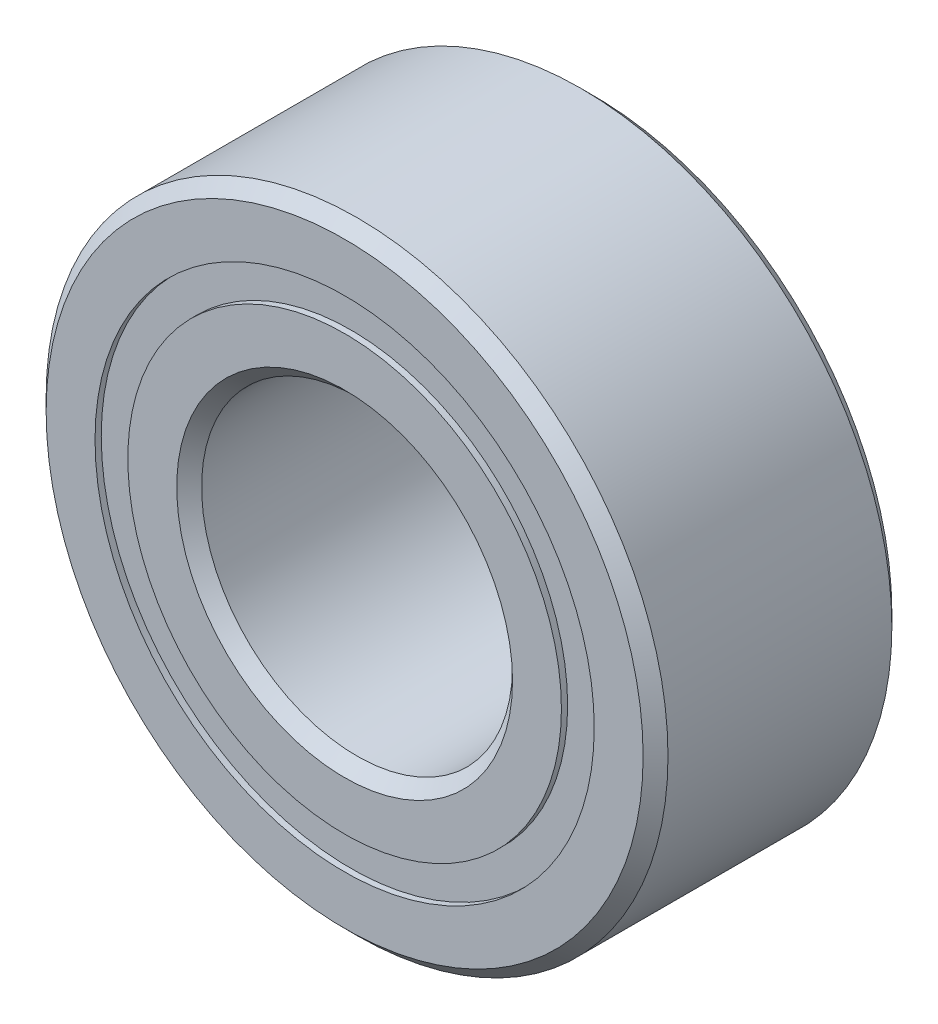
ISO-10303-21;
HEADER;
FILE_DESCRIPTION(('STEP AP214'),'2;1');
FILE_NAME('part.step','',(''),(''),'','','');
FILE_SCHEMA(('AUTOMOTIVE_DESIGN { 1 0 10303 214 1 1 1 1 }'));
ENDSEC;
DATA;
#1=APPLICATION_CONTEXT('core data for automotive mechanical design processes');
#2=APPLICATION_PROTOCOL_DEFINITION('international standard','automotive_design',2000,#1);
#3=PRODUCT_CONTEXT('',#1,'mechanical');
#4=PRODUCT('Part','Part','',(#3));
#5=PRODUCT_RELATED_PRODUCT_CATEGORY('part','',(#4));
#6=PRODUCT_DEFINITION_FORMATION('','',#4);
#7=PRODUCT_DEFINITION_CONTEXT('part definition',#1,'design');
#8=PRODUCT_DEFINITION('design','',#6,#7);
#9=PRODUCT_DEFINITION_SHAPE('','',#8);
#10=(LENGTH_UNIT() NAMED_UNIT(*) SI_UNIT(.MILLI.,.METRE.));
#11=(NAMED_UNIT(*) PLANE_ANGLE_UNIT() SI_UNIT($,.RADIAN.));
#12=(NAMED_UNIT(*) SI_UNIT($,.STERADIAN.) SOLID_ANGLE_UNIT());
#13=UNCERTAINTY_MEASURE_WITH_UNIT(LENGTH_MEASURE(1.E-05),#10,'distance_accuracy_value','');
#14=(GEOMETRIC_REPRESENTATION_CONTEXT(3) GLOBAL_UNCERTAINTY_ASSIGNED_CONTEXT((#13)) GLOBAL_UNIT_ASSIGNED_CONTEXT((#10,
#11,#12)) REPRESENTATION_CONTEXT('',''));
#15=CARTESIAN_POINT('',(0.,0.,0.));
#16=DIRECTION('',(0.,0.,1.));
#17=DIRECTION('',(1.,0.,0.));
#18=AXIS2_PLACEMENT_3D('',#15,#16,#17);
#19=CARTESIAN_POINT('',(0.,3.18590315934042,-1.50812500000014));
#20=DIRECTION('',(0.,0.,1.));
#21=DIRECTION('',(1.,0.,0.));
#22=AXIS2_PLACEMENT_3D('',#19,#20,#21);
#23=PLANE('',#22);
#24=CARTESIAN_POINT('',(0.,0.,-1.50812500000022));
#25=DIRECTION('',(0.,0.,1.));
#26=DIRECTION('',(1.,0.,0.));
#27=AXIS2_PLACEMENT_3D('',#24,#25,#26);
#28=CIRCLE('',#27,3.18590315934066);
#29=CARTESIAN_POINT('',(3.18590315934066,0.,-1.50812500000022));
#30=VERTEX_POINT('',#29);
#31=EDGE_CURVE('E59',#30,#30,#28,.T.);
#32=ORIENTED_EDGE('',*,*,#31,.F.);
#33=EDGE_LOOP('',(#32));
#34=FACE_BOUND('',#33,.T.);
#35=CARTESIAN_POINT('',(0.,0.,-1.50812500000022));
#36=DIRECTION('',(0.,0.,1.));
#37=DIRECTION('',(1.,0.,0.));
#38=AXIS2_PLACEMENT_3D('',#35,#36,#37);
#39=CIRCLE('',#38,2.76722184065934);
#40=CARTESIAN_POINT('',(2.76722184065934,0.,-1.50812500000022));
#41=VERTEX_POINT('',#40);
#42=EDGE_CURVE('E11',#41,#41,#39,.T.);
#43=ORIENTED_EDGE('',*,*,#42,.T.);
#44=EDGE_LOOP('',(#43));
#45=FACE_BOUND('',#44,.T.);
#46=ADVANCED_FACE('F45',(#34,#45),#23,.F.);
#47=CARTESIAN_POINT('',(0.,0.,1.58750000000016));
#48=DIRECTION('',(0.,0.,1.));
#49=DIRECTION('',(1.,0.,0.));
#50=AXIS2_PLACEMENT_3D('',#47,#48,#49);
#51=CYLINDRICAL_SURFACE('',#50,2.76722184065934);
#52=ORIENTED_EDGE('',*,*,#42,.F.);
#53=EDGE_LOOP('',(#52));
#54=FACE_BOUND('',#53,.T.);
#55=CARTESIAN_POINT('',(0.,0.,-0.735956624828324));
#56=DIRECTION('',(0.,0.,1.));
#57=DIRECTION('',(1.,0.,0.));
#58=AXIS2_PLACEMENT_3D('',#55,#56,#57);
#59=CIRCLE('',#58,2.76722184065934);
#60=CARTESIAN_POINT('',(2.76722184065934,0.,-0.735956624828324));
#61=VERTEX_POINT('',#60);
#62=EDGE_CURVE('E51',#61,#61,#59,.T.);
#63=ORIENTED_EDGE('',*,*,#62,.T.);
#64=EDGE_LOOP('',(#63));
#65=FACE_BOUND('',#64,.T.);
#66=ADVANCED_FACE('F68',(#54,#65),#51,.F.);
#67=CARTESIAN_POINT('',(0.,3.18590315934042,-0.73595662482831));
#68=DIRECTION('',(0.,0.,-1.));
#69=DIRECTION('',(-1.,0.,0.));
#70=AXIS2_PLACEMENT_3D('',#67,#68,#69);
#71=PLANE('',#70);
#72=ORIENTED_EDGE('',*,*,#62,.F.);
#73=EDGE_LOOP('',(#72));
#74=FACE_BOUND('',#73,.T.);
#75=CARTESIAN_POINT('',(0.,0.,-0.735956624828324));
#76=DIRECTION('',(0.,0.,1.));
#77=DIRECTION('',(1.,0.,0.));
#78=AXIS2_PLACEMENT_3D('',#75,#76,#77);
#79=CIRCLE('',#78,3.18590315934066);
#80=CARTESIAN_POINT('',(3.18590315934066,0.,-0.735956624828324));
#81=VERTEX_POINT('',#80);
#82=EDGE_CURVE('E55',#81,#81,#79,.T.);
#83=ORIENTED_EDGE('',*,*,#82,.T.);
#84=EDGE_LOOP('',(#83));
#85=FACE_BOUND('',#84,.T.);
#86=ADVANCED_FACE('F72',(#74,#85),#71,.F.);
#87=CARTESIAN_POINT('',(0.,0.,1.58750000000016));
#88=DIRECTION('',(0.,0.,1.));
#89=DIRECTION('',(1.,0.,0.));
#90=AXIS2_PLACEMENT_3D('',#87,#88,#89);
#91=CYLINDRICAL_SURFACE('',#90,3.18590315934066);
#92=ORIENTED_EDGE('',*,*,#82,.F.);
#93=EDGE_LOOP('',(#92));
#94=FACE_BOUND('',#93,.T.);
#95=ORIENTED_EDGE('',*,*,#31,.T.);
#96=EDGE_LOOP('',(#95));
#97=FACE_BOUND('',#96,.T.);
#98=ADVANCED_FACE('F65',(#94,#97),#91,.T.);
#99=CLOSED_SHELL('',(#46,#66,#86,#98));
#100=MANIFOLD_SOLID_BREP('B2',#99);
#101=CARTESIAN_POINT('',(0.,3.18590315934042,1.50812499999994));
#102=DIRECTION('',(0.,0.,-1.));
#103=DIRECTION('',(-1.,0.,0.));
#104=AXIS2_PLACEMENT_3D('',#101,#102,#103);
#105=PLANE('',#104);
#106=CARTESIAN_POINT('',(0.,0.,1.50812499999999));
#107=DIRECTION('',(0.,0.,1.));
#108=DIRECTION('',(1.,0.,0.));
#109=AXIS2_PLACEMENT_3D('',#106,#107,#108);
#110=CIRCLE('',#109,2.76722184065934);
#111=CARTESIAN_POINT('',(2.76722184065934,0.,1.50812499999999));
#112=VERTEX_POINT('',#111);
#113=EDGE_CURVE('E44',#112,#112,#110,.T.);
#114=ORIENTED_EDGE('',*,*,#113,.F.);
#115=EDGE_LOOP('',(#114));
#116=FACE_BOUND('',#115,.T.);
#117=CARTESIAN_POINT('',(0.,0.,1.50812499999999));
#118=DIRECTION('',(0.,0.,1.));
#119=DIRECTION('',(1.,0.,0.));
#120=AXIS2_PLACEMENT_3D('',#117,#118,#119);
#121=CIRCLE('',#120,3.18590315934066);
#122=CARTESIAN_POINT('',(3.18590315934066,0.,1.50812499999999));
#123=VERTEX_POINT('',#122);
#124=EDGE_CURVE('E126',#123,#123,#121,.T.);
#125=ORIENTED_EDGE('',*,*,#124,.T.);
#126=EDGE_LOOP('',(#125));
#127=FACE_BOUND('',#126,.T.);
#128=ADVANCED_FACE('F112',(#116,#127),#105,.F.);
#129=CARTESIAN_POINT('',(0.,0.,1.58750000000016));
#130=DIRECTION('',(0.,0.,1.));
#131=DIRECTION('',(1.,0.,0.));
#132=AXIS2_PLACEMENT_3D('',#129,#130,#131);
#133=CYLINDRICAL_SURFACE('',#132,2.76722184065934);
#134=CARTESIAN_POINT('',(0.,0.,0.735956624828144));
#135=DIRECTION('',(0.,0.,1.));
#136=DIRECTION('',(1.,0.,0.));
#137=AXIS2_PLACEMENT_3D('',#134,#135,#136);
#138=CIRCLE('',#137,2.76722184065934);
#139=CARTESIAN_POINT('',(2.76722184065934,0.,0.735956624828144));
#140=VERTEX_POINT('',#139);
#141=EDGE_CURVE('E118',#140,#140,#138,.T.);
#142=ORIENTED_EDGE('',*,*,#141,.F.);
#143=EDGE_LOOP('',(#142));
#144=FACE_BOUND('',#143,.T.);
#145=ORIENTED_EDGE('',*,*,#113,.T.);
#146=EDGE_LOOP('',(#145));
#147=FACE_BOUND('',#146,.T.);
#148=ADVANCED_FACE('F141',(#144,#147),#133,.F.);
#149=CARTESIAN_POINT('',(0.,3.18590315934042,0.73595662482813));
#150=DIRECTION('',(0.,0.,1.));
#151=DIRECTION('',(1.,0.,0.));
#152=AXIS2_PLACEMENT_3D('',#149,#150,#151);
#153=PLANE('',#152);
#154=CARTESIAN_POINT('',(0.,0.,0.735956624828144));
#155=DIRECTION('',(0.,0.,1.));
#156=DIRECTION('',(1.,0.,0.));
#157=AXIS2_PLACEMENT_3D('',#154,#155,#156);
#158=CIRCLE('',#157,3.18590315934066);
#159=CARTESIAN_POINT('',(3.18590315934066,0.,0.735956624828144));
#160=VERTEX_POINT('',#159);
#161=EDGE_CURVE('E122',#160,#160,#158,.T.);
#162=ORIENTED_EDGE('',*,*,#161,.F.);
#163=EDGE_LOOP('',(#162));
#164=FACE_BOUND('',#163,.T.);
#165=ORIENTED_EDGE('',*,*,#141,.T.);
#166=EDGE_LOOP('',(#165));
#167=FACE_BOUND('',#166,.T.);
#168=ADVANCED_FACE('F136',(#164,#167),#153,.F.);
#169=CARTESIAN_POINT('',(0.,0.,1.58750000000016));
#170=DIRECTION('',(0.,0.,1.));
#171=DIRECTION('',(1.,0.,0.));
#172=AXIS2_PLACEMENT_3D('',#169,#170,#171);
#173=CYLINDRICAL_SURFACE('',#172,3.18590315934066);
#174=ORIENTED_EDGE('',*,*,#124,.F.);
#175=EDGE_LOOP('',(#174));
#176=FACE_BOUND('',#175,.T.);
#177=ORIENTED_EDGE('',*,*,#161,.T.);
#178=EDGE_LOOP('',(#177));
#179=FACE_BOUND('',#178,.T.);
#180=ADVANCED_FACE('F133',(#176,#179),#173,.T.);
#181=CLOSED_SHELL('',(#128,#148,#168,#180));
#182=MANIFOLD_SOLID_BREP('B6',#181);
#183=CARTESIAN_POINT('',(-1.48828124999989,2.57777874095222,0.));
#184=DIRECTION('',(0.,0.,1.));
#185=DIRECTION('',(-0.499999999999989,0.866025403784445,0.));
#186=AXIS2_PLACEMENT_3D('',#183,#184,#185);
#187=SPHERICAL_SURFACE('',#186,0.735956624828183);
#188=CARTESIAN_POINT('',(-1.48828124999989,2.57777874095222,0.735956624828183));
#189=VERTEX_POINT('',#188);
#190=VERTEX_LOOP('',#189);
#191=FACE_BOUND('',#190,.T.);
#192=ADVANCED_FACE('F179',(#191),#187,.T.);
#193=CLOSED_SHELL('',(#192));
#194=MANIFOLD_SOLID_BREP('B39',#193);
#195=CARTESIAN_POINT('',(-2.57777874095222,1.48828125000033,0.));
#196=DIRECTION('',(0.,0.,1.));
#197=DIRECTION('',(-0.866025403784433,0.500000000000011,0.));
#198=AXIS2_PLACEMENT_3D('',#195,#196,#197);
#199=SPHERICAL_SURFACE('',#198,0.735956624828183);
#200=CARTESIAN_POINT('',(-2.57777874095222,1.48828125000033,0.735956624828141));
#201=VERTEX_POINT('',#200);
#202=VERTEX_LOOP('',#201);
#203=FACE_BOUND('',#202,.T.);
#204=ADVANCED_FACE('F199',(#203),#199,.T.);
#205=CLOSED_SHELL('',(#204));
#206=MANIFOLD_SOLID_BREP('B108',#205);
#207=CARTESIAN_POINT('',(-2.97656249999978,0.,0.));
#208=DIRECTION('',(0.,0.,1.));
#209=DIRECTION('',(-1.,0.,0.));
#210=AXIS2_PLACEMENT_3D('',#207,#208,#209);
#211=SPHERICAL_SURFACE('',#210,0.735956624828183);
#212=CARTESIAN_POINT('',(-2.97656249999978,0.,0.735956624828169));
#213=VERTEX_POINT('',#212);
#214=VERTEX_LOOP('',#213);
#215=FACE_BOUND('',#214,.T.);
#216=ADVANCED_FACE('F219',(#215),#211,.T.);
#217=CLOSED_SHELL('',(#216));
#218=MANIFOLD_SOLID_BREP('B175',#217);
#219=CARTESIAN_POINT('',(-2.57777874095222,-1.48828125000033,0.));
#220=DIRECTION('',(0.,0.,1.));
#221=DIRECTION('',(-0.866025403784443,-0.499999999999992,0.));
#222=AXIS2_PLACEMENT_3D('',#219,#220,#221);
#223=SPHERICAL_SURFACE('',#222,0.735956624828183);
#224=CARTESIAN_POINT('',(-2.57777874095222,-1.48828125000033,0.735956624828141));
#225=VERTEX_POINT('',#224);
#226=VERTEX_LOOP('',#225);
#227=FACE_BOUND('',#226,.T.);
#228=ADVANCED_FACE('F239',(#227),#223,.T.);
#229=CLOSED_SHELL('',(#228));
#230=MANIFOLD_SOLID_BREP('B195',#229);
#231=CARTESIAN_POINT('',(-1.48828124999989,-2.57777874095222,0.));
#232=DIRECTION('',(0.,0.,1.));
#233=DIRECTION('',(-0.500000000000007,-0.866025403784435,0.));
#234=AXIS2_PLACEMENT_3D('',#231,#232,#233);
#235=SPHERICAL_SURFACE('',#234,0.735956624828183);
#236=CARTESIAN_POINT('',(-1.48828124999989,-2.57777874095222,0.735956624828141));
#237=VERTEX_POINT('',#236);
#238=VERTEX_LOOP('',#237);
#239=FACE_BOUND('',#238,.T.);
#240=ADVANCED_FACE('F259',(#239),#235,.T.);
#241=CLOSED_SHELL('',(#240));
#242=MANIFOLD_SOLID_BREP('B215',#241);
#243=CARTESIAN_POINT('',(0.,-2.97656249999978,0.));
#244=DIRECTION('',(0.,0.,1.));
#245=DIRECTION('',(0.,-1.,0.));
#246=AXIS2_PLACEMENT_3D('',#243,#244,#245);
#247=SPHERICAL_SURFACE('',#246,0.735956624828183);
#248=CARTESIAN_POINT('',(0.,-2.97656249999978,0.735956624828155));
#249=VERTEX_POINT('',#248);
#250=VERTEX_LOOP('',#249);
#251=FACE_BOUND('',#250,.T.);
#252=ADVANCED_FACE('F279',(#251),#247,.T.);
#253=CLOSED_SHELL('',(#252));
#254=MANIFOLD_SOLID_BREP('B235',#253);
#255=CARTESIAN_POINT('',(1.48828124999989,-2.57777874095222,0.));
#256=DIRECTION('',(0.,0.,1.));
#257=DIRECTION('',(0.499999999999995,-0.866025403784442,0.));
#258=AXIS2_PLACEMENT_3D('',#255,#256,#257);
#259=SPHERICAL_SURFACE('',#258,0.735956624828183);
#260=CARTESIAN_POINT('',(1.48828124999989,-2.57777874095222,0.735956624828155));
#261=VERTEX_POINT('',#260);
#262=VERTEX_LOOP('',#261);
#263=FACE_BOUND('',#262,.T.);
#264=ADVANCED_FACE('F299',(#263),#259,.T.);
#265=CLOSED_SHELL('',(#264));
#266=MANIFOLD_SOLID_BREP('B255',#265);
#267=CARTESIAN_POINT('',(2.57777874095222,-1.48828125000033,0.));
#268=DIRECTION('',(0.,0.,1.));
#269=DIRECTION('',(0.866025403784437,-0.500000000000005,0.));
#270=AXIS2_PLACEMENT_3D('',#267,#268,#269);
#271=SPHERICAL_SURFACE('',#270,0.735956624828183);
#272=CARTESIAN_POINT('',(2.57777874095222,-1.48828125000033,0.735956624828169));
#273=VERTEX_POINT('',#272);
#274=VERTEX_LOOP('',#273);
#275=FACE_BOUND('',#274,.T.);
#276=ADVANCED_FACE('F319',(#275),#271,.T.);
#277=CLOSED_SHELL('',(#276));
#278=MANIFOLD_SOLID_BREP('B275',#277);
#279=CARTESIAN_POINT('',(2.97656249999978,0.,0.));
#280=DIRECTION('',(0.,0.,1.));
#281=DIRECTION('',(1.,0.,0.));
#282=AXIS2_PLACEMENT_3D('',#279,#280,#281);
#283=SPHERICAL_SURFACE('',#282,0.735956624828183);
#284=CARTESIAN_POINT('',(2.97656249999978,0.,0.735956624828197));
#285=VERTEX_POINT('',#284);
#286=VERTEX_LOOP('',#285);
#287=FACE_BOUND('',#286,.T.);
#288=ADVANCED_FACE('F339',(#287),#283,.T.);
#289=CLOSED_SHELL('',(#288));
#290=MANIFOLD_SOLID_BREP('B295',#289);
#291=CARTESIAN_POINT('',(2.57777874095222,1.48828125000033,0.));
#292=DIRECTION('',(0.,0.,1.));
#293=DIRECTION('',(0.86602540378444,0.499999999999998,0.));
#294=AXIS2_PLACEMENT_3D('',#291,#292,#293);
#295=SPHERICAL_SURFACE('',#294,0.735956624828183);
#296=CARTESIAN_POINT('',(2.57777874095222,1.48828125000033,0.735956624828169));
#297=VERTEX_POINT('',#296);
#298=VERTEX_LOOP('',#297);
#299=FACE_BOUND('',#298,.T.);
#300=ADVANCED_FACE('F359',(#299),#295,.T.);
#301=CLOSED_SHELL('',(#300));
#302=MANIFOLD_SOLID_BREP('B315',#301);
#303=CARTESIAN_POINT('',(1.48828124999989,2.57777874095222,0.));
#304=DIRECTION('',(0.,0.,1.));
#305=DIRECTION('',(0.500000000000001,0.866025403784438,0.));
#306=AXIS2_PLACEMENT_3D('',#303,#304,#305);
#307=SPHERICAL_SURFACE('',#306,0.735956624828183);
#308=CARTESIAN_POINT('',(1.48828124999989,2.57777874095222,0.735956624828155));
#309=VERTEX_POINT('',#308);
#310=VERTEX_LOOP('',#309);
#311=FACE_BOUND('',#310,.T.);
#312=ADVANCED_FACE('F379',(#311),#307,.T.);
#313=CLOSED_SHELL('',(#312));
#314=MANIFOLD_SOLID_BREP('B335',#313);
#315=CARTESIAN_POINT('',(0.,2.97656249999978,0.));
#316=DIRECTION('',(0.,0.,1.));
#317=DIRECTION('',(0.,1.,0.));
#318=AXIS2_PLACEMENT_3D('',#315,#316,#317);
#319=SPHERICAL_SURFACE('',#318,0.735956624828183);
#320=CARTESIAN_POINT('',(0.,2.97656249999978,0.735956624828266));
#321=VERTEX_POINT('',#320);
#322=VERTEX_LOOP('',#321);
#323=FACE_BOUND('',#322,.T.);
#324=ADVANCED_FACE('F401',(#323),#319,.T.);
#325=CLOSED_SHELL('',(#324));
#326=MANIFOLD_SOLID_BREP('B355',#325);
#327=CARTESIAN_POINT('',(0.,2.76722184065914,1.58749999999999));
#328=DIRECTION('',(0.,0.,-1.));
#329=DIRECTION('',(-1.,0.,0.));
#330=AXIS2_PLACEMENT_3D('',#327,#328,#329);
#331=PLANE('',#330);
#332=CARTESIAN_POINT('',(0.,0.,1.58750000000016));
#333=DIRECTION('',(0.,0.,1.));
#334=DIRECTION('',(1.,0.,0.));
#335=AXIS2_PLACEMENT_3D('',#332,#333,#334);
#336=CIRCLE('',#335,2.143125);
#337=CARTESIAN_POINT('',(2.143125,0.,1.58750000000016));
#338=VERTEX_POINT('',#337);
#339=EDGE_CURVE('E448',#338,#338,#336,.T.);
#340=ORIENTED_EDGE('',*,*,#339,.F.);
#341=EDGE_LOOP('',(#340));
#342=FACE_BOUND('',#341,.T.);
#343=CARTESIAN_POINT('',(0.,0.,1.58750000000016));
#344=DIRECTION('',(0.,0.,1.));
#345=DIRECTION('',(1.,0.,0.));
#346=AXIS2_PLACEMENT_3D('',#343,#344,#345);
#347=CIRCLE('',#346,2.76722184065934);
#348=CARTESIAN_POINT('',(2.76722184065934,0.,1.58750000000016));
#349=VERTEX_POINT('',#348);
#350=EDGE_CURVE('E400',#349,#349,#347,.T.);
#351=ORIENTED_EDGE('',*,*,#350,.T.);
#352=EDGE_LOOP('',(#351));
#353=FACE_BOUND('',#352,.T.);
#354=ADVANCED_FACE('F420',(#342,#353),#331,.F.);
#355=CARTESIAN_POINT('',(0.,0.,1.58750000000016));
#356=DIRECTION('',(0.,0.,1.));
#357=DIRECTION('',(1.,0.,0.));
#358=AXIS2_PLACEMENT_3D('',#355,#356,#357);
#359=CYLINDRICAL_SURFACE('',#358,2.76722184065934);
#360=ORIENTED_EDGE('',*,*,#350,.F.);
#361=EDGE_LOOP('',(#360));
#362=FACE_BOUND('',#361,.T.);
#363=CARTESIAN_POINT('',(0.,0.,0.705555555555543));
#364=DIRECTION('',(0.,0.,1.));
#365=DIRECTION('',(1.,0.,0.));
#366=AXIS2_PLACEMENT_3D('',#363,#364,#365);
#367=CIRCLE('',#366,2.76722184065934);
#368=CARTESIAN_POINT('',(2.76722184065934,0.,0.705555555555543));
#369=VERTEX_POINT('',#368);
#370=EDGE_CURVE('E426',#369,#369,#367,.T.);
#371=ORIENTED_EDGE('',*,*,#370,.T.);
#372=EDGE_LOOP('',(#371));
#373=FACE_BOUND('',#372,.T.);
#374=ADVANCED_FACE('F455',(#362,#373),#359,.T.);
#375=CARTESIAN_POINT('',(0.,0.,0.));
#376=DIRECTION('',(0.,0.,1.));
#377=DIRECTION('',(1.,0.,0.));
#378=AXIS2_PLACEMENT_3D('',#375,#376,#377);
#379=TOROIDAL_SURFACE('',#378,2.97656249999999,0.735956624828181);
#380=ORIENTED_EDGE('',*,*,#370,.F.);
#381=EDGE_LOOP('',(#380));
#382=FACE_BOUND('',#381,.T.);
#383=CARTESIAN_POINT('',(0.,0.,-0.705555555555612));
#384=DIRECTION('',(0.,0.,1.));
#385=DIRECTION('',(1.,0.,0.));
#386=AXIS2_PLACEMENT_3D('',#383,#384,#385);
#387=CIRCLE('',#386,2.76722184065934);
#388=CARTESIAN_POINT('',(2.76722184065934,0.,-0.705555555555612));
#389=VERTEX_POINT('',#388);
#390=EDGE_CURVE('E430',#389,#389,#387,.T.);
#391=ORIENTED_EDGE('',*,*,#390,.T.);
#392=EDGE_LOOP('',(#391));
#393=FACE_BOUND('',#392,.T.);
#394=ADVANCED_FACE('F459',(#382,#393),#379,.F.);
#395=CARTESIAN_POINT('',(0.,0.,1.58750000000016));
#396=DIRECTION('',(0.,0.,1.));
#397=DIRECTION('',(1.,0.,0.));
#398=AXIS2_PLACEMENT_3D('',#395,#396,#397);
#399=CYLINDRICAL_SURFACE('',#398,2.76722184065934);
#400=ORIENTED_EDGE('',*,*,#390,.F.);
#401=EDGE_LOOP('',(#400));
#402=FACE_BOUND('',#401,.T.);
#403=CARTESIAN_POINT('',(0.,0.,-1.58750000000012));
#404=DIRECTION('',(0.,0.,1.));
#405=DIRECTION('',(1.,0.,0.));
#406=AXIS2_PLACEMENT_3D('',#403,#404,#405);
#407=CIRCLE('',#406,2.76722184065934);
#408=CARTESIAN_POINT('',(2.76722184065934,0.,-1.58750000000012));
#409=VERTEX_POINT('',#408);
#410=EDGE_CURVE('E434',#409,#409,#407,.T.);
#411=ORIENTED_EDGE('',*,*,#410,.T.);
#412=EDGE_LOOP('',(#411));
#413=FACE_BOUND('',#412,.T.);
#414=ADVANCED_FACE('F464',(#402,#413),#399,.T.);
#415=CARTESIAN_POINT('',(0.,2.14312499999991,-1.58750000000012));
#416=DIRECTION('',(0.,0.,1.));
#417=DIRECTION('',(1.,0.,0.));
#418=AXIS2_PLACEMENT_3D('',#415,#416,#417);
#419=PLANE('',#418);
#420=ORIENTED_EDGE('',*,*,#410,.F.);
#421=EDGE_LOOP('',(#420));
#422=FACE_BOUND('',#421,.T.);
#423=CARTESIAN_POINT('',(0.,0.,-1.58750000000012));
#424=DIRECTION('',(0.,0.,1.));
#425=DIRECTION('',(1.,0.,0.));
#426=AXIS2_PLACEMENT_3D('',#423,#424,#425);
#427=CIRCLE('',#426,2.143125);
#428=CARTESIAN_POINT('',(2.143125,0.,-1.58750000000012));
#429=VERTEX_POINT('',#428);
#430=EDGE_CURVE('E439',#429,#429,#427,.T.);
#431=ORIENTED_EDGE('',*,*,#430,.T.);
#432=EDGE_LOOP('',(#431));
#433=FACE_BOUND('',#432,.T.);
#434=ADVANCED_FACE('F470',(#422,#433),#419,.F.);
#435=CARTESIAN_POINT('',(0.,0.,-1.42875000000009));
#436=DIRECTION('',(0.,0.,-1.));
#437=DIRECTION('',(-1.,0.,0.));
#438=AXIS2_PLACEMENT_3D('',#435,#436,#437);
#439=CONICAL_SURFACE('',#438,1.984375,0.78539816339745);
#440=ORIENTED_EDGE('',*,*,#430,.F.);
#441=EDGE_LOOP('',(#440));
#442=FACE_BOUND('',#441,.T.);
#443=CARTESIAN_POINT('',(0.,0.,-1.42875000000009));
#444=DIRECTION('',(0.,0.,1.));
#445=DIRECTION('',(1.,0.,0.));
#446=AXIS2_PLACEMENT_3D('',#443,#444,#445);
#447=CIRCLE('',#446,1.984375);
#448=CARTESIAN_POINT('',(1.984375,0.,-1.42875000000009));
#449=VERTEX_POINT('',#448);
#450=EDGE_CURVE('E442',#449,#449,#447,.T.);
#451=ORIENTED_EDGE('',*,*,#450,.T.);
#452=EDGE_LOOP('',(#451));
#453=FACE_BOUND('',#452,.T.);
#454=ADVANCED_FACE('F474',(#442,#453),#439,.F.);
#455=CARTESIAN_POINT('',(0.,0.,1.58750000000016));
#456=DIRECTION('',(0.,0.,1.));
#457=DIRECTION('',(1.,0.,0.));
#458=AXIS2_PLACEMENT_3D('',#455,#456,#457);
#459=CYLINDRICAL_SURFACE('',#458,1.984375);
#460=ORIENTED_EDGE('',*,*,#450,.F.);
#461=EDGE_LOOP('',(#460));
#462=FACE_BOUND('',#461,.T.);
#463=CARTESIAN_POINT('',(0.,0.,1.42875000000001));
#464=DIRECTION('',(0.,0.,1.));
#465=DIRECTION('',(1.,0.,0.));
#466=AXIS2_PLACEMENT_3D('',#463,#464,#465);
#467=CIRCLE('',#466,1.984375);
#468=CARTESIAN_POINT('',(1.984375,0.,1.42875000000001));
#469=VERTEX_POINT('',#468);
#470=EDGE_CURVE('E445',#469,#469,#467,.T.);
#471=ORIENTED_EDGE('',*,*,#470,.T.);
#472=EDGE_LOOP('',(#471));
#473=FACE_BOUND('',#472,.T.);
#474=ADVANCED_FACE('F478',(#462,#473),#459,.F.);
#475=CARTESIAN_POINT('',(0.,0.,1.58750000000016));
#476=DIRECTION('',(0.,0.,1.));
#477=DIRECTION('',(1.,0.,0.));
#478=AXIS2_PLACEMENT_3D('',#475,#476,#477);
#479=CONICAL_SURFACE('',#478,2.143125,0.785398163397448);
#480=ORIENTED_EDGE('',*,*,#470,.F.);
#481=EDGE_LOOP('',(#480));
#482=FACE_BOUND('',#481,.T.);
#483=ORIENTED_EDGE('',*,*,#339,.T.);
#484=EDGE_LOOP('',(#483));
#485=FACE_BOUND('',#484,.T.);
#486=ADVANCED_FACE('F452',(#482,#485),#479,.F.);
#487=CLOSED_SHELL('',(#354,#374,#394,#414,#434,#454,#474,#486));
#488=MANIFOLD_SOLID_BREP('B375',#487);
#489=CARTESIAN_POINT('',(0.,0.,1.42875000000001));
#490=DIRECTION('',(0.,0.,-1.));
#491=DIRECTION('',(-1.,0.,0.));
#492=AXIS2_PLACEMENT_3D('',#489,#490,#491);
#493=CONICAL_SURFACE('',#492,3.96875,0.785398163397445);
#494=CARTESIAN_POINT('',(0.,0.,1.58750000000016));
#495=DIRECTION('',(0.,0.,1.));
#496=DIRECTION('',(1.,0.,0.));
#497=AXIS2_PLACEMENT_3D('',#494,#495,#496);
#498=CIRCLE('',#497,3.81);
#499=CARTESIAN_POINT('',(3.81,0.,1.58750000000016));
#500=VERTEX_POINT('',#499);
#501=EDGE_CURVE('E569',#500,#500,#498,.T.);
#502=ORIENTED_EDGE('',*,*,#501,.F.);
#503=EDGE_LOOP('',(#502));
#504=FACE_BOUND('',#503,.T.);
#505=CARTESIAN_POINT('',(0.,0.,1.42875000000001));
#506=DIRECTION('',(0.,0.,1.));
#507=DIRECTION('',(1.,0.,0.));
#508=AXIS2_PLACEMENT_3D('',#505,#506,#507);
#509=CIRCLE('',#508,3.96875);
#510=CARTESIAN_POINT('',(3.96875,0.,1.42875000000001));
#511=VERTEX_POINT('',#510);
#512=EDGE_CURVE('E419',#511,#511,#509,.T.);
#513=ORIENTED_EDGE('',*,*,#512,.T.);
#514=EDGE_LOOP('',(#513));
#515=FACE_BOUND('',#514,.T.);
#516=ADVANCED_FACE('F541',(#504,#515),#493,.T.);
#517=CARTESIAN_POINT('',(0.,0.,1.58750000000016));
#518=DIRECTION('',(0.,0.,1.));
#519=DIRECTION('',(1.,0.,0.));
#520=AXIS2_PLACEMENT_3D('',#517,#518,#519);
#521=CYLINDRICAL_SURFACE('',#520,3.96875);
#522=ORIENTED_EDGE('',*,*,#512,.F.);
#523=EDGE_LOOP('',(#522));
#524=FACE_BOUND('',#523,.T.);
#525=CARTESIAN_POINT('',(0.,0.,-1.42875000000009));
#526=DIRECTION('',(0.,0.,1.));
#527=DIRECTION('',(1.,0.,0.));
#528=AXIS2_PLACEMENT_3D('',#525,#526,#527);
#529=CIRCLE('',#528,3.96875);
#530=CARTESIAN_POINT('',(3.96875,0.,-1.42875000000009));
#531=VERTEX_POINT('',#530);
#532=EDGE_CURVE('E547',#531,#531,#529,.T.);
#533=ORIENTED_EDGE('',*,*,#532,.T.);
#534=EDGE_LOOP('',(#533));
#535=FACE_BOUND('',#534,.T.);
#536=ADVANCED_FACE('F576',(#524,#535),#521,.T.);
#537=CARTESIAN_POINT('',(0.,0.,-1.58750000000012));
#538=DIRECTION('',(0.,0.,1.));
#539=DIRECTION('',(1.,0.,0.));
#540=AXIS2_PLACEMENT_3D('',#537,#538,#539);
#541=CONICAL_SURFACE('',#540,3.81,0.785398163397443);
#542=ORIENTED_EDGE('',*,*,#532,.F.);
#543=EDGE_LOOP('',(#542));
#544=FACE_BOUND('',#543,.T.);
#545=CARTESIAN_POINT('',(0.,0.,-1.58750000000012));
#546=DIRECTION('',(0.,0.,1.));
#547=DIRECTION('',(1.,0.,0.));
#548=AXIS2_PLACEMENT_3D('',#545,#546,#547);
#549=CIRCLE('',#548,3.81);
#550=CARTESIAN_POINT('',(3.81,0.,-1.58750000000012));
#551=VERTEX_POINT('',#550);
#552=EDGE_CURVE('E551',#551,#551,#549,.T.);
#553=ORIENTED_EDGE('',*,*,#552,.T.);
#554=EDGE_LOOP('',(#553));
#555=FACE_BOUND('',#554,.T.);
#556=ADVANCED_FACE('F580',(#544,#555),#541,.T.);
#557=CARTESIAN_POINT('',(0.,3.80999999999965,-1.58750000000012));
#558=DIRECTION('',(0.,0.,1.));
#559=DIRECTION('',(1.,0.,0.));
#560=AXIS2_PLACEMENT_3D('',#557,#558,#559);
#561=PLANE('',#560);
#562=ORIENTED_EDGE('',*,*,#552,.F.);
#563=EDGE_LOOP('',(#562));
#564=FACE_BOUND('',#563,.T.);
#565=CARTESIAN_POINT('',(0.,0.,-1.58750000000012));
#566=DIRECTION('',(0.,0.,1.));
#567=DIRECTION('',(1.,0.,0.));
#568=AXIS2_PLACEMENT_3D('',#565,#566,#567);
#569=CIRCLE('',#568,3.18590315934066);
#570=CARTESIAN_POINT('',(3.18590315934066,0.,-1.58750000000012));
#571=VERTEX_POINT('',#570);
#572=EDGE_CURVE('E555',#571,#571,#569,.T.);
#573=ORIENTED_EDGE('',*,*,#572,.T.);
#574=EDGE_LOOP('',(#573));
#575=FACE_BOUND('',#574,.T.);
#576=ADVANCED_FACE('F585',(#564,#575),#561,.F.);
#577=CARTESIAN_POINT('',(0.,0.,1.58750000000016));
#578=DIRECTION('',(0.,0.,1.));
#579=DIRECTION('',(1.,0.,0.));
#580=AXIS2_PLACEMENT_3D('',#577,#578,#579);
#581=CYLINDRICAL_SURFACE('',#580,3.18590315934066);
#582=ORIENTED_EDGE('',*,*,#572,.F.);
#583=EDGE_LOOP('',(#582));
#584=FACE_BOUND('',#583,.T.);
#585=CARTESIAN_POINT('',(0.,0.,-0.705555555555612));
#586=DIRECTION('',(0.,0.,1.));
#587=DIRECTION('',(1.,0.,0.));
#588=AXIS2_PLACEMENT_3D('',#585,#586,#587);
#589=CIRCLE('',#588,3.18590315934066);
#590=CARTESIAN_POINT('',(3.18590315934066,0.,-0.705555555555612));
#591=VERTEX_POINT('',#590);
#592=EDGE_CURVE('E560',#591,#591,#589,.T.);
#593=ORIENTED_EDGE('',*,*,#592,.T.);
#594=EDGE_LOOP('',(#593));
#595=FACE_BOUND('',#594,.T.);
#596=ADVANCED_FACE('F591',(#584,#595),#581,.F.);
#597=CARTESIAN_POINT('',(0.,0.,0.));
#598=DIRECTION('',(0.,0.,1.));
#599=DIRECTION('',(1.,0.,0.));
#600=AXIS2_PLACEMENT_3D('',#597,#598,#599);
#601=TOROIDAL_SURFACE('',#600,2.9765625,0.735956624828183);
#602=ORIENTED_EDGE('',*,*,#592,.F.);
#603=EDGE_LOOP('',(#602));
#604=FACE_BOUND('',#603,.T.);
#605=CARTESIAN_POINT('',(0.,0.,0.705555555555543));
#606=DIRECTION('',(0.,0.,1.));
#607=DIRECTION('',(1.,0.,0.));
#608=AXIS2_PLACEMENT_3D('',#605,#606,#607);
#609=CIRCLE('',#608,3.18590315934066);
#610=CARTESIAN_POINT('',(3.18590315934066,0.,0.705555555555543));
#611=VERTEX_POINT('',#610);
#612=EDGE_CURVE('E563',#611,#611,#609,.T.);
#613=ORIENTED_EDGE('',*,*,#612,.T.);
#614=EDGE_LOOP('',(#613));
#615=FACE_BOUND('',#614,.T.);
#616=ADVANCED_FACE('F595',(#604,#615),#601,.F.);
#617=CARTESIAN_POINT('',(0.,0.,1.58750000000016));
#618=DIRECTION('',(0.,0.,1.));
#619=DIRECTION('',(1.,0.,0.));
#620=AXIS2_PLACEMENT_3D('',#617,#618,#619);
#621=CYLINDRICAL_SURFACE('',#620,3.18590315934066);
#622=ORIENTED_EDGE('',*,*,#612,.F.);
#623=EDGE_LOOP('',(#622));
#624=FACE_BOUND('',#623,.T.);
#625=CARTESIAN_POINT('',(0.,0.,1.58750000000016));
#626=DIRECTION('',(0.,0.,1.));
#627=DIRECTION('',(1.,0.,0.));
#628=AXIS2_PLACEMENT_3D('',#625,#626,#627);
#629=CIRCLE('',#628,3.18590315934066);
#630=CARTESIAN_POINT('',(3.18590315934066,0.,1.58750000000016));
#631=VERTEX_POINT('',#630);
#632=EDGE_CURVE('E566',#631,#631,#629,.T.);
#633=ORIENTED_EDGE('',*,*,#632,.T.);
#634=EDGE_LOOP('',(#633));
#635=FACE_BOUND('',#634,.T.);
#636=ADVANCED_FACE('F599',(#624,#635),#621,.F.);
#637=CARTESIAN_POINT('',(0.,3.80999999999965,1.58749999999996));
#638=DIRECTION('',(0.,0.,-1.));
#639=DIRECTION('',(-1.,0.,0.));
#640=AXIS2_PLACEMENT_3D('',#637,#638,#639);
#641=PLANE('',#640);
#642=ORIENTED_EDGE('',*,*,#632,.F.);
#643=EDGE_LOOP('',(#642));
#644=FACE_BOUND('',#643,.T.);
#645=ORIENTED_EDGE('',*,*,#501,.T.);
#646=EDGE_LOOP('',(#645));
#647=FACE_BOUND('',#646,.T.);
#648=ADVANCED_FACE('F573',(#644,#647),#641,.F.);
#649=CLOSED_SHELL('',(#516,#536,#556,#576,#596,#616,#636,#648));
#650=MANIFOLD_SOLID_BREP('B395',#649);
#651=ADVANCED_BREP_SHAPE_REPRESENTATION('',(#18,#100,#182,#194,#206,#218,#230,#242,#254,#266,
#278,#290,#302,#314,#326,#488,#650),#14);
#652=SHAPE_DEFINITION_REPRESENTATION(#9,#651);
ENDSEC;
END-ISO-10303-21;
